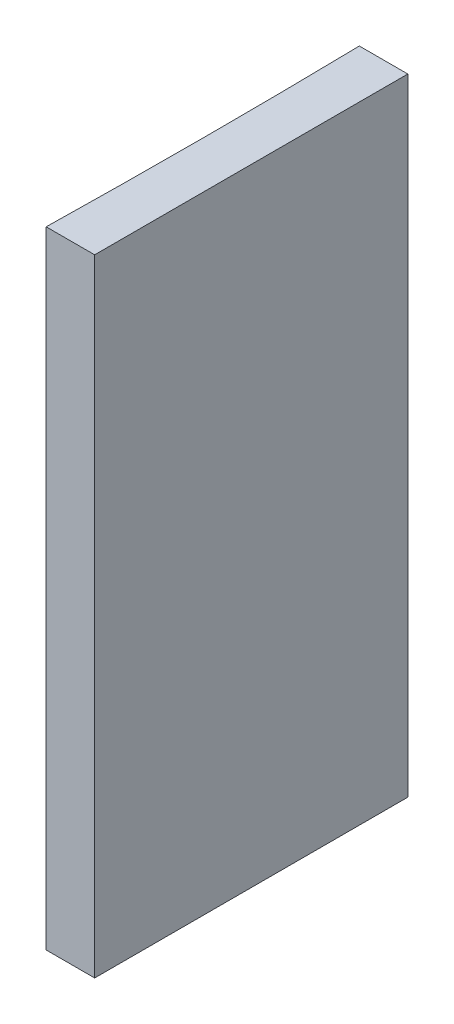
ISO-10303-21;
HEADER;
FILE_DESCRIPTION(('STEP AP214'),'2;1');
FILE_NAME('part.step','',(''),(''),'','','');
FILE_SCHEMA(('AUTOMOTIVE_DESIGN { 1 0 10303 214 1 1 1 1 }'));
ENDSEC;
DATA;
#1=APPLICATION_CONTEXT('core data for automotive mechanical design processes');
#2=APPLICATION_PROTOCOL_DEFINITION('international standard','automotive_design',2000,#1);
#3=PRODUCT_CONTEXT('',#1,'mechanical');
#4=PRODUCT('Part','Part','',(#3));
#5=PRODUCT_RELATED_PRODUCT_CATEGORY('part','',(#4));
#6=PRODUCT_DEFINITION_FORMATION('','',#4);
#7=PRODUCT_DEFINITION_CONTEXT('part definition',#1,'design');
#8=PRODUCT_DEFINITION('design','',#6,#7);
#9=PRODUCT_DEFINITION_SHAPE('','',#8);
#10=(LENGTH_UNIT() NAMED_UNIT(*) SI_UNIT(.MILLI.,.METRE.));
#11=(NAMED_UNIT(*) PLANE_ANGLE_UNIT() SI_UNIT($,.RADIAN.));
#12=(NAMED_UNIT(*) SI_UNIT($,.STERADIAN.) SOLID_ANGLE_UNIT());
#13=UNCERTAINTY_MEASURE_WITH_UNIT(LENGTH_MEASURE(1.E-05),#10,'distance_accuracy_value','');
#14=(GEOMETRIC_REPRESENTATION_CONTEXT(3) GLOBAL_UNCERTAINTY_ASSIGNED_CONTEXT((#13)) GLOBAL_UNIT_ASSIGNED_CONTEXT((#10,
#11,#12)) REPRESENTATION_CONTEXT('',''));
#15=CARTESIAN_POINT('',(0.,0.,0.));
#16=DIRECTION('',(0.,0.,1.));
#17=DIRECTION('',(1.,0.,0.));
#18=AXIS2_PLACEMENT_3D('',#15,#16,#17);
#19=CARTESIAN_POINT('',(0.,40.,0.));
#20=DIRECTION('',(0.,0.,1.));
#21=DIRECTION('',(1.,0.,0.));
#22=AXIS2_PLACEMENT_3D('',#19,#20,#21);
#23=PLANE('',#22);
#24=DIRECTION('',(-1.,0.,0.));
#25=VECTOR('',#24,1.);
#26=CARTESIAN_POINT('',(0.,0.,0.));
#27=LINE('',#26,#25);
#28=CARTESIAN_POINT('',(0.,0.,0.));
#29=VERTEX_POINT('',#28);
#30=CARTESIAN_POINT('',(-3.09675828382883,0.,0.));
#31=VERTEX_POINT('',#30);
#32=EDGE_CURVE('E100',#29,#31,#27,.T.);
#33=ORIENTED_EDGE('',*,*,#32,.T.);
#34=DIRECTION('',(0.,-1.,0.));
#35=VECTOR('',#34,1.);
#36=CARTESIAN_POINT('',(-3.09675828382883,40.,0.));
#37=LINE('',#36,#35);
#38=CARTESIAN_POINT('',(-3.09675828382883,40.,0.));
#39=VERTEX_POINT('',#38);
#40=EDGE_CURVE('E11',#39,#31,#37,.T.);
#41=ORIENTED_EDGE('',*,*,#40,.F.);
#42=DIRECTION('',(-1.,0.,0.));
#43=VECTOR('',#42,1.);
#44=CARTESIAN_POINT('',(0.,40.,0.));
#45=LINE('',#44,#43);
#46=CARTESIAN_POINT('',(0.,40.,0.));
#47=VERTEX_POINT('',#46);
#48=EDGE_CURVE('E88',#47,#39,#45,.T.);
#49=ORIENTED_EDGE('',*,*,#48,.F.);
#50=DIRECTION('',(0.,-1.,0.));
#51=VECTOR('',#50,1.);
#52=CARTESIAN_POINT('',(0.,40.,0.));
#53=LINE('',#52,#51);
#54=EDGE_CURVE('E96',#47,#29,#53,.T.);
#55=ORIENTED_EDGE('',*,*,#54,.T.);
#56=EDGE_LOOP('',(#33,#41,#49,#55));
#57=FACE_BOUND('',#56,.T.);
#58=ADVANCED_FACE('F37',(#57),#23,.F.);
#59=CARTESIAN_POINT('',(-519.8,40.,10.0000000000001));
#60=DIRECTION('',(0.,-1.,0.));
#61=DIRECTION('',(0.,0.,-1.));
#62=AXIS2_PLACEMENT_3D('',#59,#60,#61);
#63=CYLINDRICAL_SURFACE('',#62,516.8);
#64=CARTESIAN_POINT('',(-519.8,0.,10.0000000000001));
#65=DIRECTION('',(0.,-1.,0.));
#66=DIRECTION('',(0.,0.,1.));
#67=AXIS2_PLACEMENT_3D('',#64,#65,#66);
#68=CIRCLE('',#67,516.8);
#69=CARTESIAN_POINT('',(-3.09675828382883,0.,20.));
#70=VERTEX_POINT('',#69);
#71=EDGE_CURVE('E92',#31,#70,#68,.T.);
#72=ORIENTED_EDGE('',*,*,#71,.T.);
#73=DIRECTION('',(0.,-1.,0.));
#74=VECTOR('',#73,1.);
#75=CARTESIAN_POINT('',(-3.09675828382883,40.,20.));
#76=LINE('',#75,#74);
#77=CARTESIAN_POINT('',(-3.09675828382883,40.,20.));
#78=VERTEX_POINT('',#77);
#79=EDGE_CURVE('E45',#78,#70,#76,.T.);
#80=ORIENTED_EDGE('',*,*,#79,.F.);
#81=CARTESIAN_POINT('',(-519.8,40.,10.0000000000001));
#82=DIRECTION('',(0.,-1.,0.));
#83=DIRECTION('',(0.,0.,1.));
#84=AXIS2_PLACEMENT_3D('',#81,#82,#83);
#85=CIRCLE('',#84,516.8);
#86=EDGE_CURVE('E83',#39,#78,#85,.T.);
#87=ORIENTED_EDGE('',*,*,#86,.F.);
#88=ORIENTED_EDGE('',*,*,#40,.T.);
#89=EDGE_LOOP('',(#72,#80,#87,#88));
#90=FACE_BOUND('',#89,.T.);
#91=ADVANCED_FACE('F91',(#90),#63,.F.);
#92=CARTESIAN_POINT('',(0.,40.,20.));
#93=DIRECTION('',(0.,0.,-1.));
#94=DIRECTION('',(-1.,0.,0.));
#95=AXIS2_PLACEMENT_3D('',#92,#93,#94);
#96=PLANE('',#95);
#97=DIRECTION('',(1.,0.,0.));
#98=VECTOR('',#97,1.);
#99=CARTESIAN_POINT('',(0.,0.,20.));
#100=LINE('',#99,#98);
#101=CARTESIAN_POINT('',(0.,0.,20.));
#102=VERTEX_POINT('',#101);
#103=EDGE_CURVE('E70',#70,#102,#100,.T.);
#104=ORIENTED_EDGE('',*,*,#103,.T.);
#105=DIRECTION('',(0.,-1.,0.));
#106=VECTOR('',#105,1.);
#107=CARTESIAN_POINT('',(0.,40.,20.));
#108=LINE('',#107,#106);
#109=CARTESIAN_POINT('',(0.,40.,20.));
#110=VERTEX_POINT('',#109);
#111=EDGE_CURVE('E93',#110,#102,#108,.T.);
#112=ORIENTED_EDGE('',*,*,#111,.F.);
#113=DIRECTION('',(1.,0.,0.));
#114=VECTOR('',#113,1.);
#115=CARTESIAN_POINT('',(0.,40.,20.));
#116=LINE('',#115,#114);
#117=EDGE_CURVE('E86',#78,#110,#116,.T.);
#118=ORIENTED_EDGE('',*,*,#117,.F.);
#119=ORIENTED_EDGE('',*,*,#79,.T.);
#120=EDGE_LOOP('',(#104,#112,#118,#119));
#121=FACE_BOUND('',#120,.T.);
#122=ADVANCED_FACE('F94',(#121),#96,.F.);
#123=CARTESIAN_POINT('',(0.,40.,0.));
#124=DIRECTION('',(-1.,0.,0.));
#125=DIRECTION('',(0.,0.,1.));
#126=AXIS2_PLACEMENT_3D('',#123,#124,#125);
#127=PLANE('',#126);
#128=DIRECTION('',(0.,0.,-1.));
#129=VECTOR('',#128,1.);
#130=CARTESIAN_POINT('',(0.,0.,0.));
#131=LINE('',#130,#129);
#132=EDGE_CURVE('E76',#102,#29,#131,.T.);
#133=ORIENTED_EDGE('',*,*,#132,.T.);
#134=ORIENTED_EDGE('',*,*,#54,.F.);
#135=DIRECTION('',(0.,0.,-1.));
#136=VECTOR('',#135,1.);
#137=CARTESIAN_POINT('',(0.,40.,0.));
#138=LINE('',#137,#136);
#139=EDGE_CURVE('E53',#110,#47,#138,.T.);
#140=ORIENTED_EDGE('',*,*,#139,.F.);
#141=ORIENTED_EDGE('',*,*,#111,.T.);
#142=EDGE_LOOP('',(#133,#134,#140,#141));
#143=FACE_BOUND('',#142,.T.);
#144=ADVANCED_FACE('F107',(#143),#127,.F.);
#145=CARTESIAN_POINT('',(-519.8,40.,10.0000000000001));
#146=DIRECTION('',(0.,1.,0.));
#147=DIRECTION('',(0.,0.,1.));
#148=AXIS2_PLACEMENT_3D('',#145,#146,#147);
#149=PLANE('',#148);
#150=ORIENTED_EDGE('',*,*,#48,.T.);
#151=ORIENTED_EDGE('',*,*,#86,.T.);
#152=ORIENTED_EDGE('',*,*,#117,.T.);
#153=ORIENTED_EDGE('',*,*,#139,.T.);
#154=EDGE_LOOP('',(#150,#151,#152,#153));
#155=FACE_BOUND('',#154,.T.);
#156=ADVANCED_FACE('F84',(#155),#149,.T.);
#157=CARTESIAN_POINT('',(-519.8,0.,10.0000000000001));
#158=DIRECTION('',(0.,1.,0.));
#159=DIRECTION('',(0.,0.,1.));
#160=AXIS2_PLACEMENT_3D('',#157,#158,#159);
#161=PLANE('',#160);
#162=ORIENTED_EDGE('',*,*,#32,.F.);
#163=ORIENTED_EDGE('',*,*,#132,.F.);
#164=ORIENTED_EDGE('',*,*,#103,.F.);
#165=ORIENTED_EDGE('',*,*,#71,.F.);
#166=EDGE_LOOP('',(#162,#163,#164,#165));
#167=FACE_BOUND('',#166,.T.);
#168=ADVANCED_FACE('F110',(#167),#161,.F.);
#169=CLOSED_SHELL('',(#58,#91,#122,#144,#156,#168));
#170=MANIFOLD_SOLID_BREP('B2',#169);
#171=ADVANCED_BREP_SHAPE_REPRESENTATION('',(#18,#170),#14);
#172=SHAPE_DEFINITION_REPRESENTATION(#9,#171);
ENDSEC;
END-ISO-10303-21;
